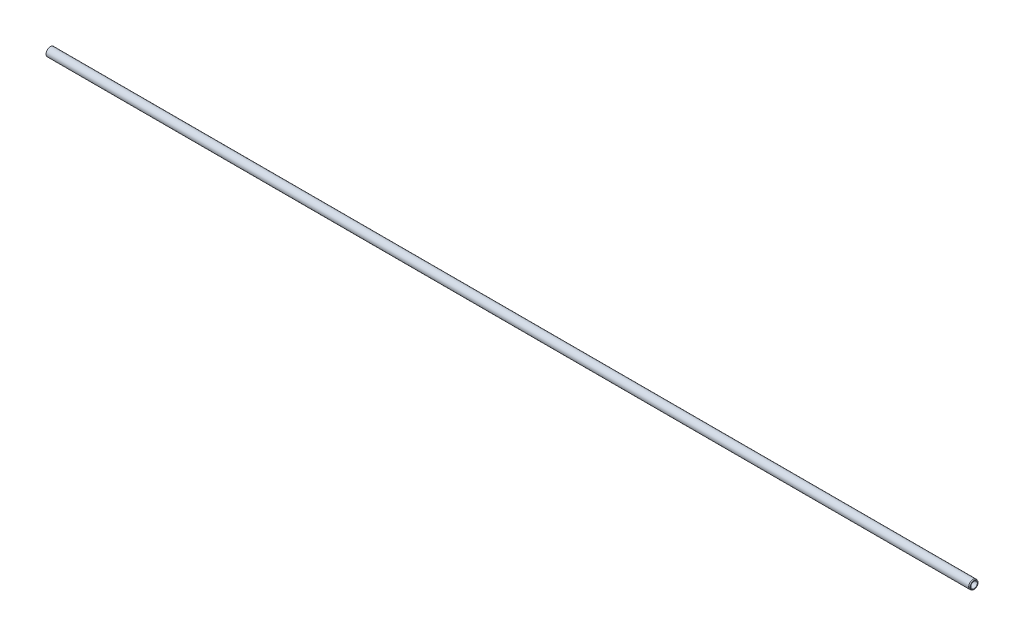
ISO-10303-21;
HEADER;
FILE_DESCRIPTION(('STEP AP214'),'2;1');
FILE_NAME('part.step','',(''),(''),'','','');
FILE_SCHEMA(('AUTOMOTIVE_DESIGN { 1 0 10303 214 1 1 1 1 }'));
ENDSEC;
DATA;
#1=APPLICATION_CONTEXT('core data for automotive mechanical design processes');
#2=APPLICATION_PROTOCOL_DEFINITION('international standard','automotive_design',2000,#1);
#3=PRODUCT_CONTEXT('',#1,'mechanical');
#4=PRODUCT('Part','Part','',(#3));
#5=PRODUCT_RELATED_PRODUCT_CATEGORY('part','',(#4));
#6=PRODUCT_DEFINITION_FORMATION('','',#4);
#7=PRODUCT_DEFINITION_CONTEXT('part definition',#1,'design');
#8=PRODUCT_DEFINITION('design','',#6,#7);
#9=PRODUCT_DEFINITION_SHAPE('','',#8);
#10=(LENGTH_UNIT() NAMED_UNIT(*) SI_UNIT(.MILLI.,.METRE.));
#11=(NAMED_UNIT(*) PLANE_ANGLE_UNIT() SI_UNIT($,.RADIAN.));
#12=(NAMED_UNIT(*) SI_UNIT($,.STERADIAN.) SOLID_ANGLE_UNIT());
#13=UNCERTAINTY_MEASURE_WITH_UNIT(LENGTH_MEASURE(1.E-05),#10,'distance_accuracy_value','');
#14=(GEOMETRIC_REPRESENTATION_CONTEXT(3) GLOBAL_UNCERTAINTY_ASSIGNED_CONTEXT((#13)) GLOBAL_UNIT_ASSIGNED_CONTEXT((#10,
#11,#12)) REPRESENTATION_CONTEXT('',''));
#15=CARTESIAN_POINT('',(0.,0.,0.));
#16=DIRECTION('',(0.,0.,1.));
#17=DIRECTION('',(1.,0.,0.));
#18=AXIS2_PLACEMENT_3D('',#15,#16,#17);
#19=CARTESIAN_POINT('',(0.,0.,0.));
#20=DIRECTION('',(-1.,0.,0.));
#21=DIRECTION('',(0.,0.,1.));
#22=AXIS2_PLACEMENT_3D('',#19,#20,#21);
#23=CYLINDRICAL_SURFACE('',#22,10.);
#24=CARTESIAN_POINT('',(2137.5,0.,0.));
#25=DIRECTION('',(-1.,0.,0.));
#26=DIRECTION('',(0.,0.,1.));
#27=AXIS2_PLACEMENT_3D('',#24,#25,#26);
#28=CIRCLE('',#27,10.);
#29=CARTESIAN_POINT('',(2137.5,0.,10.));
#30=VERTEX_POINT('',#29);
#31=EDGE_CURVE('E10',#30,#30,#28,.T.);
#32=ORIENTED_EDGE('',*,*,#31,.T.);
#33=EDGE_LOOP('',(#32));
#34=FACE_BOUND('',#33,.T.);
#35=CARTESIAN_POINT('',(0.,0.,0.));
#36=DIRECTION('',(-1.,0.,0.));
#37=DIRECTION('',(0.,0.,1.));
#38=AXIS2_PLACEMENT_3D('',#35,#36,#37);
#39=CIRCLE('',#38,10.);
#40=CARTESIAN_POINT('',(0.,0.,10.));
#41=VERTEX_POINT('',#40);
#42=EDGE_CURVE('E60',#41,#41,#39,.T.);
#43=ORIENTED_EDGE('',*,*,#42,.F.);
#44=EDGE_LOOP('',(#43));
#45=FACE_BOUND('',#44,.T.);
#46=ADVANCED_FACE('F41',(#34,#45),#23,.T.);
#47=CARTESIAN_POINT('',(2137.5,0.,0.));
#48=DIRECTION('',(-1.,0.,0.));
#49=DIRECTION('',(0.,0.,1.));
#50=AXIS2_PLACEMENT_3D('',#47,#48,#49);
#51=CONICAL_SURFACE('',#50,10.,0.349065850398867);
#52=CARTESIAN_POINT('',(2140.,0.,0.));
#53=DIRECTION('',(-1.,0.,0.));
#54=DIRECTION('',(0.,0.,1.));
#55=AXIS2_PLACEMENT_3D('',#52,#53,#54);
#56=CIRCLE('',#55,9.09007441433451);
#57=CARTESIAN_POINT('',(2140.,0.,9.09007441433451));
#58=VERTEX_POINT('',#57);
#59=EDGE_CURVE('E47',#58,#58,#56,.T.);
#60=ORIENTED_EDGE('',*,*,#59,.T.);
#61=EDGE_LOOP('',(#60));
#62=FACE_BOUND('',#61,.T.);
#63=ORIENTED_EDGE('',*,*,#31,.F.);
#64=EDGE_LOOP('',(#63));
#65=FACE_BOUND('',#64,.T.);
#66=ADVANCED_FACE('F67',(#62,#65),#51,.T.);
#67=CARTESIAN_POINT('',(2140.,9.09007441433451,0.));
#68=DIRECTION('',(1.,0.,0.));
#69=DIRECTION('',(0.,0.,-1.));
#70=AXIS2_PLACEMENT_3D('',#67,#68,#69);
#71=PLANE('',#70);
#72=CARTESIAN_POINT('',(2140.,0.,0.));
#73=DIRECTION('',(-1.,0.,0.));
#74=DIRECTION('',(0.,0.,1.));
#75=AXIS2_PLACEMENT_3D('',#72,#73,#74);
#76=CIRCLE('',#75,7.5);
#77=CARTESIAN_POINT('',(2140.,0.,7.5));
#78=VERTEX_POINT('',#77);
#79=EDGE_CURVE('E51',#78,#78,#76,.T.);
#80=ORIENTED_EDGE('',*,*,#79,.T.);
#81=EDGE_LOOP('',(#80));
#82=FACE_BOUND('',#81,.T.);
#83=ORIENTED_EDGE('',*,*,#59,.F.);
#84=EDGE_LOOP('',(#83));
#85=FACE_BOUND('',#84,.T.);
#86=ADVANCED_FACE('F71',(#82,#85),#71,.T.);
#87=CARTESIAN_POINT('',(0.,0.,0.));
#88=DIRECTION('',(-1.,0.,0.));
#89=DIRECTION('',(0.,0.,1.));
#90=AXIS2_PLACEMENT_3D('',#87,#88,#89);
#91=CYLINDRICAL_SURFACE('',#90,7.5);
#92=ORIENTED_EDGE('',*,*,#79,.F.);
#93=EDGE_LOOP('',(#92));
#94=FACE_BOUND('',#93,.T.);
#95=CARTESIAN_POINT('',(0.,0.,0.));
#96=DIRECTION('',(-1.,0.,0.));
#97=DIRECTION('',(0.,0.,1.));
#98=AXIS2_PLACEMENT_3D('',#95,#96,#97);
#99=CIRCLE('',#98,7.5);
#100=CARTESIAN_POINT('',(0.,0.,7.5));
#101=VERTEX_POINT('',#100);
#102=EDGE_CURVE('E55',#101,#101,#99,.T.);
#103=ORIENTED_EDGE('',*,*,#102,.T.);
#104=EDGE_LOOP('',(#103));
#105=FACE_BOUND('',#104,.T.);
#106=ADVANCED_FACE('F75',(#94,#105),#91,.F.);
#107=CARTESIAN_POINT('',(0.,10.,0.));
#108=DIRECTION('',(1.,0.,0.));
#109=DIRECTION('',(0.,0.,-1.));
#110=AXIS2_PLACEMENT_3D('',#107,#108,#109);
#111=PLANE('',#110);
#112=ORIENTED_EDGE('',*,*,#102,.F.);
#113=EDGE_LOOP('',(#112));
#114=FACE_BOUND('',#113,.T.);
#115=ORIENTED_EDGE('',*,*,#42,.T.);
#116=EDGE_LOOP('',(#115));
#117=FACE_BOUND('',#116,.T.);
#118=ADVANCED_FACE('F64',(#114,#117),#111,.F.);
#119=CLOSED_SHELL('',(#46,#66,#86,#106,#118));
#120=MANIFOLD_SOLID_BREP('B2',#119);
#121=ADVANCED_BREP_SHAPE_REPRESENTATION('',(#18,#120),#14);
#122=SHAPE_DEFINITION_REPRESENTATION(#9,#121);
ENDSEC;
END-ISO-10303-21;
